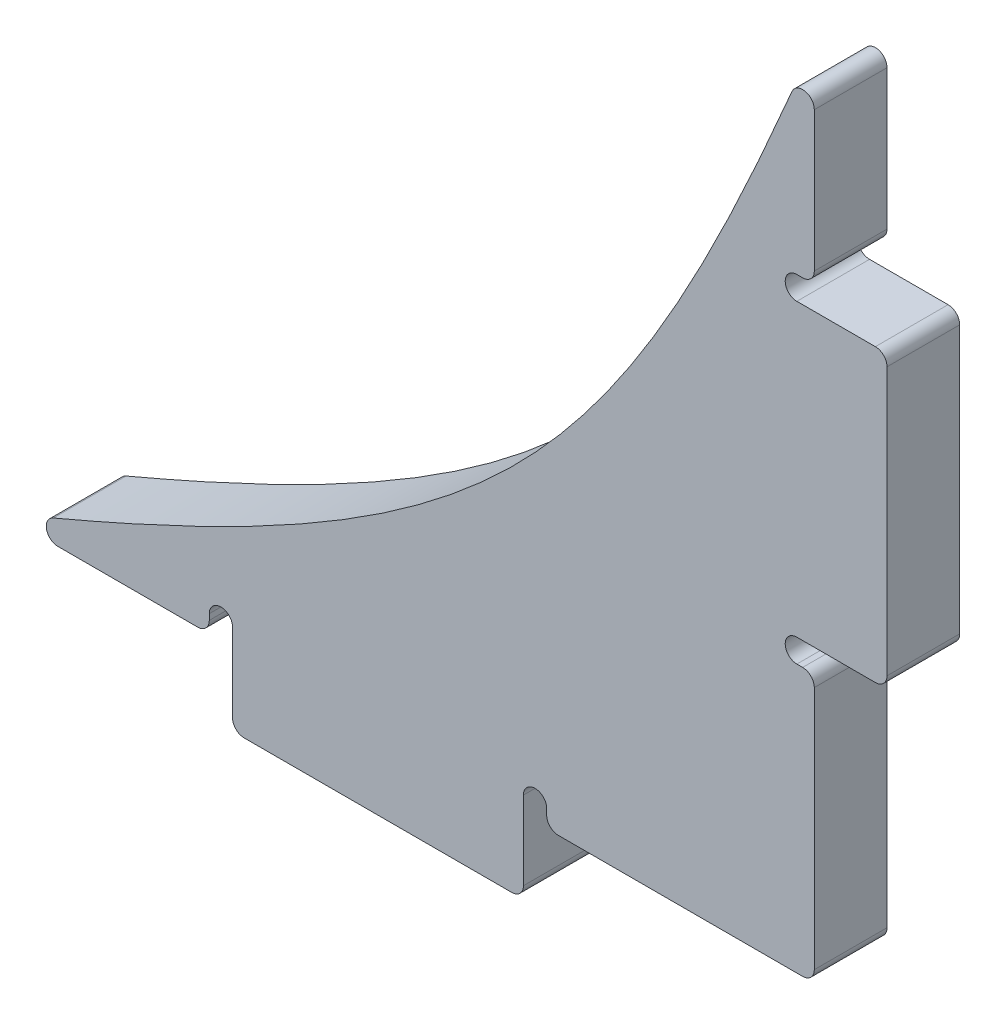
ISO-10303-21;
HEADER;
FILE_DESCRIPTION(('STEP AP214'),'2;1');
FILE_NAME('part.step','',(''),(''),'','','');
FILE_SCHEMA(('AUTOMOTIVE_DESIGN { 1 0 10303 214 1 1 1 1 }'));
ENDSEC;
DATA;
#1=APPLICATION_CONTEXT('core data for automotive mechanical design processes');
#2=APPLICATION_PROTOCOL_DEFINITION('international standard','automotive_design',2000,#1);
#3=PRODUCT_CONTEXT('',#1,'mechanical');
#4=PRODUCT('Part','Part','',(#3));
#5=PRODUCT_RELATED_PRODUCT_CATEGORY('part','',(#4));
#6=PRODUCT_DEFINITION_FORMATION('','',#4);
#7=PRODUCT_DEFINITION_CONTEXT('part definition',#1,'design');
#8=PRODUCT_DEFINITION('design','',#6,#7);
#9=PRODUCT_DEFINITION_SHAPE('','',#8);
#10=(LENGTH_UNIT() NAMED_UNIT(*) SI_UNIT(.MILLI.,.METRE.));
#11=(NAMED_UNIT(*) PLANE_ANGLE_UNIT() SI_UNIT($,.RADIAN.));
#12=(NAMED_UNIT(*) SI_UNIT($,.STERADIAN.) SOLID_ANGLE_UNIT());
#13=UNCERTAINTY_MEASURE_WITH_UNIT(LENGTH_MEASURE(1.E-05),#10,'distance_accuracy_value','');
#14=(GEOMETRIC_REPRESENTATION_CONTEXT(3) GLOBAL_UNCERTAINTY_ASSIGNED_CONTEXT((#13)) GLOBAL_UNIT_ASSIGNED_CONTEXT((#10,
#11,#12)) REPRESENTATION_CONTEXT('',''));
#15=CARTESIAN_POINT('',(0.,0.,0.));
#16=DIRECTION('',(0.,0.,1.));
#17=DIRECTION('',(1.,0.,0.));
#18=AXIS2_PLACEMENT_3D('',#15,#16,#17);
#19=CARTESIAN_POINT('',(22.86,-12.7,3.175));
#20=DIRECTION('',(-1.,0.,0.));
#21=DIRECTION('',(0.,0.,1.));
#22=AXIS2_PLACEMENT_3D('',#19,#20,#21);
#23=PLANE('',#22);
#24=DIRECTION('',(0.,1.,0.));
#25=VECTOR('',#24,1.);
#26=CARTESIAN_POINT('',(22.86,-12.7,0.));
#27=LINE('',#26,#25);
#28=CARTESIAN_POINT('',(22.86,14.224,0.));
#29=VERTEX_POINT('',#28);
#30=CARTESIAN_POINT('',(22.86,20.325877747534,0.));
#31=VERTEX_POINT('',#30);
#32=EDGE_CURVE('E343',#29,#31,#27,.T.);
#33=ORIENTED_EDGE('',*,*,#32,.T.);
#34=DIRECTION('',(0.,0.,-1.));
#35=VECTOR('',#34,1.);
#36=CARTESIAN_POINT('',(22.86,20.325877747534,3.175));
#37=LINE('',#36,#35);
#38=CARTESIAN_POINT('',(22.86,20.325877747534,3.175));
#39=VERTEX_POINT('',#38);
#40=EDGE_CURVE('E444',#31,#39,#37,.F.);
#41=ORIENTED_EDGE('',*,*,#40,.T.);
#42=DIRECTION('',(0.,1.,0.));
#43=VECTOR('',#42,1.);
#44=CARTESIAN_POINT('',(22.86,-12.7,3.175));
#45=LINE('',#44,#43);
#46=CARTESIAN_POINT('',(22.86,14.224,3.175));
#47=VERTEX_POINT('',#46);
#48=EDGE_CURVE('E348',#47,#39,#45,.T.);
#49=ORIENTED_EDGE('',*,*,#48,.F.);
#50=DIRECTION('',(0.,0.,1.));
#51=VECTOR('',#50,1.);
#52=CARTESIAN_POINT('',(22.86,14.224,3.175));
#53=LINE('',#52,#51);
#54=EDGE_CURVE('E442',#47,#29,#53,.F.);
#55=ORIENTED_EDGE('',*,*,#54,.T.);
#56=EDGE_LOOP('',(#33,#41,#49,#55));
#57=FACE_BOUND('',#56,.T.);
#58=ADVANCED_FACE('F41',(#57),#23,.F.);
#59=CARTESIAN_POINT('',(22.86,-12.192,0.));
#60=VERTEX_POINT('',#59);
#61=CARTESIAN_POINT('',(22.86,-1.52399999999999,0.));
#62=VERTEX_POINT('',#61);
#63=EDGE_CURVE('E527',#60,#62,#27,.T.);
#64=ORIENTED_EDGE('',*,*,#63,.T.);
#65=DIRECTION('',(0.,0.,1.));
#66=VECTOR('',#65,1.);
#67=CARTESIAN_POINT('',(22.86,-1.52399999999999,3.175));
#68=LINE('',#67,#66);
#69=CARTESIAN_POINT('',(22.86,-1.52399999999999,3.175));
#70=VERTEX_POINT('',#69);
#71=EDGE_CURVE('E483',#62,#70,#68,.T.);
#72=ORIENTED_EDGE('',*,*,#71,.T.);
#73=CARTESIAN_POINT('',(22.86,-12.192,3.175));
#74=VERTEX_POINT('',#73);
#75=EDGE_CURVE('E344',#74,#70,#45,.T.);
#76=ORIENTED_EDGE('',*,*,#75,.F.);
#77=DIRECTION('',(0.,0.,-1.));
#78=VECTOR('',#77,1.);
#79=CARTESIAN_POINT('',(22.86,-12.192,3.175));
#80=LINE('',#79,#78);
#81=EDGE_CURVE('E480',#74,#60,#80,.T.);
#82=ORIENTED_EDGE('',*,*,#81,.T.);
#83=EDGE_LOOP('',(#64,#72,#76,#82));
#84=FACE_BOUND('',#83,.T.);
#85=ADVANCED_FACE('F372',(#84),#23,.F.);
#86=CARTESIAN_POINT('',(22.86,-12.7,3.175));
#87=DIRECTION('',(0.,1.,0.));
#88=DIRECTION('',(-1.,0.,0.));
#89=AXIS2_PLACEMENT_3D('',#86,#87,#88);
#90=PLANE('',#89);
#91=DIRECTION('',(1.,0.,0.));
#92=VECTOR('',#91,1.);
#93=CARTESIAN_POINT('',(22.86,-12.7,0.));
#94=LINE('',#93,#92);
#95=CARTESIAN_POINT('',(-10.165877747534,-12.7,0.));
#96=VERTEX_POINT('',#95);
#97=CARTESIAN_POINT('',(-4.064,-12.7,0.));
#98=VERTEX_POINT('',#97);
#99=EDGE_CURVE('E510',#96,#98,#94,.T.);
#100=ORIENTED_EDGE('',*,*,#99,.T.);
#101=DIRECTION('',(0.,0.,1.));
#102=VECTOR('',#101,1.);
#103=CARTESIAN_POINT('',(-4.064,-12.7,3.175));
#104=LINE('',#103,#102);
#105=CARTESIAN_POINT('',(-4.064,-12.7,3.175));
#106=VERTEX_POINT('',#105);
#107=EDGE_CURVE('E49',#98,#106,#104,.T.);
#108=ORIENTED_EDGE('',*,*,#107,.T.);
#109=DIRECTION('',(1.,0.,0.));
#110=VECTOR('',#109,1.);
#111=CARTESIAN_POINT('',(22.86,-12.7,3.175));
#112=LINE('',#111,#110);
#113=CARTESIAN_POINT('',(-10.165877747534,-12.7,3.175));
#114=VERTEX_POINT('',#113);
#115=EDGE_CURVE('E355',#114,#106,#112,.T.);
#116=ORIENTED_EDGE('',*,*,#115,.F.);
#117=DIRECTION('',(0.,0.,-1.));
#118=VECTOR('',#117,1.);
#119=CARTESIAN_POINT('',(-10.165877747534,-12.7,3.175));
#120=LINE('',#119,#118);
#121=EDGE_CURVE('E505',#114,#96,#120,.T.);
#122=ORIENTED_EDGE('',*,*,#121,.T.);
#123=EDGE_LOOP('',(#100,#108,#116,#122));
#124=FACE_BOUND('',#123,.T.);
#125=ADVANCED_FACE('F368',(#124),#90,.F.);
#126=CARTESIAN_POINT('',(11.684,-12.7,0.));
#127=VERTEX_POINT('',#126);
#128=CARTESIAN_POINT('',(22.352,-12.7,0.));
#129=VERTEX_POINT('',#128);
#130=EDGE_CURVE('E535',#127,#129,#94,.T.);
#131=ORIENTED_EDGE('',*,*,#130,.T.);
#132=DIRECTION('',(0.,0.,-1.));
#133=VECTOR('',#132,1.);
#134=CARTESIAN_POINT('',(22.352,-12.7,3.175));
#135=LINE('',#134,#133);
#136=CARTESIAN_POINT('',(22.352,-12.7,3.175));
#137=VERTEX_POINT('',#136);
#138=EDGE_CURVE('E490',#129,#137,#135,.F.);
#139=ORIENTED_EDGE('',*,*,#138,.T.);
#140=CARTESIAN_POINT('',(11.684,-12.7,3.175));
#141=VERTEX_POINT('',#140);
#142=EDGE_CURVE('E354',#141,#137,#112,.T.);
#143=ORIENTED_EDGE('',*,*,#142,.F.);
#144=DIRECTION('',(0.,0.,1.));
#145=VECTOR('',#144,1.);
#146=CARTESIAN_POINT('',(11.684,-12.7,3.175));
#147=LINE('',#146,#145);
#148=EDGE_CURVE('E488',#141,#127,#147,.F.);
#149=ORIENTED_EDGE('',*,*,#148,.T.);
#150=EDGE_LOOP('',(#131,#139,#143,#149));
#151=FACE_BOUND('',#150,.T.);
#152=ADVANCED_FACE('F366',(#151),#90,.F.);
#153=CARTESIAN_POINT('',(22.86,22.86,3.175));
#154=CARTESIAN_POINT('',(14.0602561210691,1.48789755157234,3.175));
#155=CARTESIAN_POINT('',(8.67210244842766,-3.90025612106915,3.175));
#156=CARTESIAN_POINT('',(-12.7,-12.7,3.175));
#157=B_SPLINE_CURVE_WITH_KNOTS('',3,(#153,#154,#155,#156),.UNSPECIFIED.,.F.,.F.,(4,4),(0.,1.),.UNSPECIFIED.);
#158=DIRECTION('',(0.,0.,-1.));
#159=VECTOR('',#158,1.);
#160=SURFACE_OF_LINEAR_EXTRUSION('',#157,#159);
#161=CARTESIAN_POINT('',(21.8843521544961,20.5242952180239,3.175));
#162=VERTEX_POINT('',#161);
#163=CARTESIAN_POINT('',(-10.3642952180239,-11.7243521544961,3.175));
#164=VERTEX_POINT('',#163);
#165=EDGE_CURVE('E347',#162,#164,#157,.T.);
#166=ORIENTED_EDGE('',*,*,#165,.F.);
#167=DIRECTION('',(0.,0.,-1.));
#168=VECTOR('',#167,1.);
#169=CARTESIAN_POINT('',(21.8843521544961,20.5242952180239,3.175));
#170=LINE('',#169,#168);
#171=CARTESIAN_POINT('',(21.8843521544961,20.5242952180239,0.));
#172=VERTEX_POINT('',#171);
#173=EDGE_CURVE('E423',#162,#172,#170,.T.);
#174=ORIENTED_EDGE('',*,*,#173,.T.);
#175=CARTESIAN_POINT('',(22.86,22.86,0.));
#176=CARTESIAN_POINT('',(14.0602561210691,1.48789755157234,0.));
#177=CARTESIAN_POINT('',(8.67210244842766,-3.90025612106915,0.));
#178=CARTESIAN_POINT('',(-12.7,-12.7,0.));
#179=B_SPLINE_CURVE_WITH_KNOTS('',3,(#175,#176,#177,#178),.UNSPECIFIED.,.F.,.F.,(4,4),(0.,1.),.UNSPECIFIED.);
#180=CARTESIAN_POINT('',(-10.3642952180239,-11.7243521544961,0.));
#181=VERTEX_POINT('',#180);
#182=EDGE_CURVE('E533',#172,#181,#179,.T.);
#183=ORIENTED_EDGE('',*,*,#182,.T.);
#184=DIRECTION('',(0.,0.,-1.));
#185=VECTOR('',#184,1.);
#186=CARTESIAN_POINT('',(-10.3642952180239,-11.7243521544961,0.));
#187=LINE('',#186,#185);
#188=EDGE_CURVE('E513',#181,#164,#187,.F.);
#189=ORIENTED_EDGE('',*,*,#188,.T.);
#190=EDGE_LOOP('',(#166,#174,#183,#189));
#191=FACE_BOUND('',#190,.T.);
#192=ADVANCED_FACE('F361',(#191),#160,.F.);
#193=CARTESIAN_POINT('',(9.7946344635613,0.365365536438696,3.175));
#194=DIRECTION('',(0.,0.,1.));
#195=DIRECTION('',(1.,0.,0.));
#196=AXIS2_PLACEMENT_3D('',#193,#194,#195);
#197=PLANE('',#196);
#198=ORIENTED_EDGE('',*,*,#48,.T.);
#199=CARTESIAN_POINT('',(22.352,20.325877747534,3.175));
#200=DIRECTION('',(0.,0.,1.));
#201=DIRECTION('',(1.,0.,0.));
#202=AXIS2_PLACEMENT_3D('',#199,#200,#201);
#203=CIRCLE('',#202,0.508);
#204=EDGE_CURVE('E465',#39,#162,#203,.T.);
#205=ORIENTED_EDGE('',*,*,#204,.T.);
#206=ORIENTED_EDGE('',*,*,#165,.T.);
#207=CARTESIAN_POINT('',(-10.165877747534,-12.192,3.175));
#208=DIRECTION('',(0.,0.,1.));
#209=DIRECTION('',(1.,0.,0.));
#210=AXIS2_PLACEMENT_3D('',#207,#208,#209);
#211=CIRCLE('',#210,0.508);
#212=EDGE_CURVE('E446',#164,#114,#211,.T.);
#213=ORIENTED_EDGE('',*,*,#212,.T.);
#214=ORIENTED_EDGE('',*,*,#115,.T.);
#215=CARTESIAN_POINT('',(-4.064,-12.192,3.175));
#216=DIRECTION('',(0.,0.,1.));
#217=DIRECTION('',(1.,0.,0.));
#218=AXIS2_PLACEMENT_3D('',#215,#216,#217);
#219=CIRCLE('',#218,0.508);
#220=CARTESIAN_POINT('',(-3.556,-12.192,3.175));
#221=VERTEX_POINT('',#220);
#222=EDGE_CURVE('E56',#106,#221,#219,.T.);
#223=ORIENTED_EDGE('',*,*,#222,.T.);
#224=DIRECTION('',(0.,-1.,0.));
#225=VECTOR('',#224,1.);
#226=CARTESIAN_POINT('',(-3.556,-11.938,3.175));
#227=LINE('',#226,#225);
#228=CARTESIAN_POINT('',(-3.556,-11.938,3.175));
#229=VERTEX_POINT('',#228);
#230=EDGE_CURVE('E255',#229,#221,#227,.T.);
#231=ORIENTED_EDGE('',*,*,#230,.F.);
#232=CARTESIAN_POINT('',(-3.048,-11.938,3.175));
#233=DIRECTION('',(0.,0.,1.));
#234=DIRECTION('',(1.,0.,0.));
#235=AXIS2_PLACEMENT_3D('',#232,#233,#234);
#236=CIRCLE('',#235,0.507999999999999);
#237=CARTESIAN_POINT('',(-2.54,-11.938,3.175));
#238=VERTEX_POINT('',#237);
#239=EDGE_CURVE('E254',#238,#229,#236,.T.);
#240=ORIENTED_EDGE('',*,*,#239,.F.);
#241=DIRECTION('',(0.,1.,0.));
#242=VECTOR('',#241,1.);
#243=CARTESIAN_POINT('',(-2.54,-15.875,3.175));
#244=LINE('',#243,#242);
#245=CARTESIAN_POINT('',(-2.54,-15.367,3.175));
#246=VERTEX_POINT('',#245);
#247=EDGE_CURVE('E336',#246,#238,#244,.T.);
#248=ORIENTED_EDGE('',*,*,#247,.F.);
#249=CARTESIAN_POINT('',(-2.032,-15.367,3.175));
#250=DIRECTION('',(0.,0.,1.));
#251=DIRECTION('',(1.,0.,0.));
#252=AXIS2_PLACEMENT_3D('',#249,#250,#251);
#253=CIRCLE('',#252,0.508);
#254=CARTESIAN_POINT('',(-2.032,-15.875,3.175));
#255=VERTEX_POINT('',#254);
#256=EDGE_CURVE('E449',#246,#255,#253,.T.);
#257=ORIENTED_EDGE('',*,*,#256,.T.);
#258=DIRECTION('',(-1.,0.,0.));
#259=VECTOR('',#258,1.);
#260=CARTESIAN_POINT('',(-2.54,-15.875,3.175));
#261=LINE('',#260,#259);
#262=CARTESIAN_POINT('',(9.652,-15.875,3.175));
#263=VERTEX_POINT('',#262);
#264=EDGE_CURVE('E333',#263,#255,#261,.T.);
#265=ORIENTED_EDGE('',*,*,#264,.F.);
#266=CARTESIAN_POINT('',(9.652,-15.367,3.175));
#267=DIRECTION('',(0.,0.,1.));
#268=DIRECTION('',(1.,0.,0.));
#269=AXIS2_PLACEMENT_3D('',#266,#267,#268);
#270=CIRCLE('',#269,0.508);
#271=CARTESIAN_POINT('',(10.16,-15.367,3.175));
#272=VERTEX_POINT('',#271);
#273=EDGE_CURVE('E451',#263,#272,#270,.T.);
#274=ORIENTED_EDGE('',*,*,#273,.T.);
#275=DIRECTION('',(0.,1.,0.));
#276=VECTOR('',#275,1.);
#277=CARTESIAN_POINT('',(10.16,-15.875,3.175));
#278=LINE('',#277,#276);
#279=CARTESIAN_POINT('',(10.16,-11.938,3.175));
#280=VERTEX_POINT('',#279);
#281=EDGE_CURVE('E338',#272,#280,#278,.T.);
#282=ORIENTED_EDGE('',*,*,#281,.T.);
#283=CARTESIAN_POINT('',(10.668,-11.938,3.175));
#284=DIRECTION('',(0.,0.,1.));
#285=DIRECTION('',(1.,0.,0.));
#286=AXIS2_PLACEMENT_3D('',#283,#284,#285);
#287=CIRCLE('',#286,0.508000000000001);
#288=CARTESIAN_POINT('',(11.176,-11.938,3.175));
#289=VERTEX_POINT('',#288);
#290=EDGE_CURVE('E278',#289,#280,#287,.T.);
#291=ORIENTED_EDGE('',*,*,#290,.F.);
#292=DIRECTION('',(0.,1.,0.));
#293=VECTOR('',#292,1.);
#294=CARTESIAN_POINT('',(11.176,-12.7,3.175));
#295=LINE('',#294,#293);
#296=CARTESIAN_POINT('',(11.176,-12.192,3.175));
#297=VERTEX_POINT('',#296);
#298=EDGE_CURVE('E281',#297,#289,#295,.T.);
#299=ORIENTED_EDGE('',*,*,#298,.F.);
#300=CARTESIAN_POINT('',(11.684,-12.192,3.175));
#301=DIRECTION('',(0.,0.,1.));
#302=DIRECTION('',(1.,0.,0.));
#303=AXIS2_PLACEMENT_3D('',#300,#301,#302);
#304=CIRCLE('',#303,0.508);
#305=EDGE_CURVE('E453',#297,#141,#304,.T.);
#306=ORIENTED_EDGE('',*,*,#305,.T.);
#307=ORIENTED_EDGE('',*,*,#142,.T.);
#308=CARTESIAN_POINT('',(22.352,-12.192,3.175));
#309=DIRECTION('',(0.,0.,1.));
#310=DIRECTION('',(1.,0.,0.));
#311=AXIS2_PLACEMENT_3D('',#308,#309,#310);
#312=CIRCLE('',#311,0.508);
#313=EDGE_CURVE('E455',#137,#74,#312,.T.);
#314=ORIENTED_EDGE('',*,*,#313,.T.);
#315=ORIENTED_EDGE('',*,*,#75,.T.);
#316=CARTESIAN_POINT('',(22.352,-1.52399999999999,3.175));
#317=DIRECTION('',(0.,0.,1.));
#318=DIRECTION('',(1.,0.,0.));
#319=AXIS2_PLACEMENT_3D('',#316,#317,#318);
#320=CIRCLE('',#319,0.508);
#321=CARTESIAN_POINT('',(22.352,-1.01599999999999,3.175));
#322=VERTEX_POINT('',#321);
#323=EDGE_CURVE('E457',#70,#322,#320,.T.);
#324=ORIENTED_EDGE('',*,*,#323,.T.);
#325=DIRECTION('',(1.,0.,0.));
#326=VECTOR('',#325,1.);
#327=CARTESIAN_POINT('',(22.098,-1.01599999999999,3.175));
#328=LINE('',#327,#326);
#329=CARTESIAN_POINT('',(22.098,-1.01599999999999,3.175));
#330=VERTEX_POINT('',#329);
#331=EDGE_CURVE('E292',#330,#322,#328,.T.);
#332=ORIENTED_EDGE('',*,*,#331,.F.);
#333=CARTESIAN_POINT('',(22.098,-0.507999999999995,3.175));
#334=DIRECTION('',(0.,0.,1.));
#335=DIRECTION('',(1.,0.,0.));
#336=AXIS2_PLACEMENT_3D('',#333,#334,#335);
#337=CIRCLE('',#336,0.507999999999997);
#338=CARTESIAN_POINT('',(22.098,0.,3.175));
#339=VERTEX_POINT('',#338);
#340=EDGE_CURVE('E288',#339,#330,#337,.T.);
#341=ORIENTED_EDGE('',*,*,#340,.F.);
#342=DIRECTION('',(-1.,0.,0.));
#343=VECTOR('',#342,1.);
#344=CARTESIAN_POINT('',(26.035,0.,3.175));
#345=LINE('',#344,#343);
#346=CARTESIAN_POINT('',(25.527,0.,3.175));
#347=VERTEX_POINT('',#346);
#348=EDGE_CURVE('E328',#347,#339,#345,.T.);
#349=ORIENTED_EDGE('',*,*,#348,.F.);
#350=CARTESIAN_POINT('',(25.527,0.508000000000005,3.175));
#351=DIRECTION('',(0.,0.,1.));
#352=DIRECTION('',(1.,0.,0.));
#353=AXIS2_PLACEMENT_3D('',#350,#351,#352);
#354=CIRCLE('',#353,0.508);
#355=CARTESIAN_POINT('',(26.035,0.508000000000005,3.175));
#356=VERTEX_POINT('',#355);
#357=EDGE_CURVE('E459',#347,#356,#354,.T.);
#358=ORIENTED_EDGE('',*,*,#357,.T.);
#359=DIRECTION('',(0.,-1.,0.));
#360=VECTOR('',#359,1.);
#361=CARTESIAN_POINT('',(26.035,0.,3.175));
#362=LINE('',#361,#360);
#363=CARTESIAN_POINT('',(26.035,12.192,3.175));
#364=VERTEX_POINT('',#363);
#365=EDGE_CURVE('E245',#364,#356,#362,.T.);
#366=ORIENTED_EDGE('',*,*,#365,.F.);
#367=CARTESIAN_POINT('',(25.527,12.192,3.175));
#368=DIRECTION('',(0.,0.,1.));
#369=DIRECTION('',(1.,0.,0.));
#370=AXIS2_PLACEMENT_3D('',#367,#368,#369);
#371=CIRCLE('',#370,0.508);
#372=CARTESIAN_POINT('',(25.527,12.7,3.175));
#373=VERTEX_POINT('',#372);
#374=EDGE_CURVE('E461',#364,#373,#371,.T.);
#375=ORIENTED_EDGE('',*,*,#374,.T.);
#376=DIRECTION('',(-1.,0.,0.));
#377=VECTOR('',#376,1.);
#378=CARTESIAN_POINT('',(26.035,12.7,3.175));
#379=LINE('',#378,#377);
#380=CARTESIAN_POINT('',(22.098,12.7,3.175));
#381=VERTEX_POINT('',#380);
#382=EDGE_CURVE('E322',#373,#381,#379,.T.);
#383=ORIENTED_EDGE('',*,*,#382,.T.);
#384=CARTESIAN_POINT('',(22.098,13.208,3.175));
#385=DIRECTION('',(0.,0.,1.));
#386=DIRECTION('',(1.,0.,0.));
#387=AXIS2_PLACEMENT_3D('',#384,#385,#386);
#388=CIRCLE('',#387,0.508000000000002);
#389=CARTESIAN_POINT('',(22.098,13.716,3.175));
#390=VERTEX_POINT('',#389);
#391=EDGE_CURVE('E307',#390,#381,#388,.T.);
#392=ORIENTED_EDGE('',*,*,#391,.F.);
#393=DIRECTION('',(-1.,0.,0.));
#394=VECTOR('',#393,1.);
#395=CARTESIAN_POINT('',(22.86,13.716,3.175));
#396=LINE('',#395,#394);
#397=CARTESIAN_POINT('',(22.352,13.716,3.175));
#398=VERTEX_POINT('',#397);
#399=EDGE_CURVE('E310',#398,#390,#396,.T.);
#400=ORIENTED_EDGE('',*,*,#399,.F.);
#401=CARTESIAN_POINT('',(22.352,14.224,3.175));
#402=DIRECTION('',(0.,0.,1.));
#403=DIRECTION('',(1.,0.,0.));
#404=AXIS2_PLACEMENT_3D('',#401,#402,#403);
#405=CIRCLE('',#404,0.508);
#406=EDGE_CURVE('E463',#398,#47,#405,.T.);
#407=ORIENTED_EDGE('',*,*,#406,.T.);
#408=EDGE_LOOP('',(#198,#205,#206,#213,#214,#223,#231,#240,#248,#257,#265,#274,#282,#291,#299,
#306,#307,#314,#315,#324,#332,#341,#349,#358,#366,#375,#383,#392,#400,#407));
#409=FACE_BOUND('',#408,.T.);
#410=ADVANCED_FACE('F365',(#409),#197,.T.);
#411=CARTESIAN_POINT('',(9.7946344635613,0.365365536438696,0.));
#412=DIRECTION('',(0.,0.,1.));
#413=DIRECTION('',(1.,0.,0.));
#414=AXIS2_PLACEMENT_3D('',#411,#412,#413);
#415=PLANE('',#414);
#416=ORIENTED_EDGE('',*,*,#182,.F.);
#417=CARTESIAN_POINT('',(22.352,20.325877747534,0.));
#418=DIRECTION('',(0.,0.,1.));
#419=DIRECTION('',(1.,0.,0.));
#420=AXIS2_PLACEMENT_3D('',#417,#418,#419);
#421=CIRCLE('',#420,0.508);
#422=EDGE_CURVE('E440',#172,#31,#421,.F.);
#423=ORIENTED_EDGE('',*,*,#422,.T.);
#424=ORIENTED_EDGE('',*,*,#32,.F.);
#425=CARTESIAN_POINT('',(22.352,14.224,0.));
#426=DIRECTION('',(0.,0.,1.));
#427=DIRECTION('',(1.,0.,0.));
#428=AXIS2_PLACEMENT_3D('',#425,#426,#427);
#429=CIRCLE('',#428,0.508);
#430=CARTESIAN_POINT('',(22.352,13.716,0.));
#431=VERTEX_POINT('',#430);
#432=EDGE_CURVE('E438',#29,#431,#429,.F.);
#433=ORIENTED_EDGE('',*,*,#432,.T.);
#434=DIRECTION('',(1.,0.,0.));
#435=VECTOR('',#434,1.);
#436=CARTESIAN_POINT('',(22.86,13.716,0.));
#437=LINE('',#436,#435);
#438=CARTESIAN_POINT('',(22.098,13.716,0.));
#439=VERTEX_POINT('',#438);
#440=EDGE_CURVE('E304',#439,#431,#437,.T.);
#441=ORIENTED_EDGE('',*,*,#440,.F.);
#442=CARTESIAN_POINT('',(22.098,13.208,0.));
#443=DIRECTION('',(0.,0.,1.));
#444=DIRECTION('',(1.,0.,0.));
#445=AXIS2_PLACEMENT_3D('',#442,#443,#444);
#446=CIRCLE('',#445,0.508000000000002);
#447=CARTESIAN_POINT('',(22.098,12.7,0.));
#448=VERTEX_POINT('',#447);
#449=EDGE_CURVE('E301',#448,#439,#446,.F.);
#450=ORIENTED_EDGE('',*,*,#449,.F.);
#451=DIRECTION('',(-1.,0.,0.));
#452=VECTOR('',#451,1.);
#453=CARTESIAN_POINT('',(26.035,12.7,0.));
#454=LINE('',#453,#452);
#455=CARTESIAN_POINT('',(25.527,12.7,0.));
#456=VERTEX_POINT('',#455);
#457=EDGE_CURVE('E324',#456,#448,#454,.T.);
#458=ORIENTED_EDGE('',*,*,#457,.F.);
#459=CARTESIAN_POINT('',(25.527,12.192,0.));
#460=DIRECTION('',(0.,0.,1.));
#461=DIRECTION('',(1.,0.,0.));
#462=AXIS2_PLACEMENT_3D('',#459,#460,#461);
#463=CIRCLE('',#462,0.508);
#464=CARTESIAN_POINT('',(26.035,12.192,0.));
#465=VERTEX_POINT('',#464);
#466=EDGE_CURVE('E436',#456,#465,#463,.F.);
#467=ORIENTED_EDGE('',*,*,#466,.T.);
#468=DIRECTION('',(0.,1.,0.));
#469=VECTOR('',#468,1.);
#470=CARTESIAN_POINT('',(26.035,0.,0.));
#471=LINE('',#470,#469);
#472=CARTESIAN_POINT('',(26.035,0.508000000000005,0.));
#473=VERTEX_POINT('',#472);
#474=EDGE_CURVE('E319',#473,#465,#471,.T.);
#475=ORIENTED_EDGE('',*,*,#474,.F.);
#476=CARTESIAN_POINT('',(25.527,0.508000000000005,0.));
#477=DIRECTION('',(0.,0.,1.));
#478=DIRECTION('',(1.,0.,0.));
#479=AXIS2_PLACEMENT_3D('',#476,#477,#478);
#480=CIRCLE('',#479,0.508);
#481=CARTESIAN_POINT('',(25.527,0.,0.));
#482=VERTEX_POINT('',#481);
#483=EDGE_CURVE('E434',#473,#482,#480,.F.);
#484=ORIENTED_EDGE('',*,*,#483,.T.);
#485=DIRECTION('',(-1.,0.,0.));
#486=VECTOR('',#485,1.);
#487=CARTESIAN_POINT('',(26.035,0.,0.));
#488=LINE('',#487,#486);
#489=CARTESIAN_POINT('',(22.098,0.,0.));
#490=VERTEX_POINT('',#489);
#491=EDGE_CURVE('E326',#482,#490,#488,.T.);
#492=ORIENTED_EDGE('',*,*,#491,.T.);
#493=CARTESIAN_POINT('',(22.098,-0.507999999999995,0.));
#494=DIRECTION('',(0.,0.,1.));
#495=DIRECTION('',(1.,0.,0.));
#496=AXIS2_PLACEMENT_3D('',#493,#494,#495);
#497=CIRCLE('',#496,0.507999999999997);
#498=CARTESIAN_POINT('',(22.098,-1.01599999999999,0.));
#499=VERTEX_POINT('',#498);
#500=EDGE_CURVE('E285',#499,#490,#497,.F.);
#501=ORIENTED_EDGE('',*,*,#500,.F.);
#502=DIRECTION('',(-1.,0.,0.));
#503=VECTOR('',#502,1.);
#504=CARTESIAN_POINT('',(22.098,-1.01599999999999,0.));
#505=LINE('',#504,#503);
#506=CARTESIAN_POINT('',(22.352,-1.01599999999999,0.));
#507=VERTEX_POINT('',#506);
#508=EDGE_CURVE('E275',#507,#499,#505,.T.);
#509=ORIENTED_EDGE('',*,*,#508,.F.);
#510=CARTESIAN_POINT('',(22.352,-1.52399999999999,0.));
#511=DIRECTION('',(0.,0.,1.));
#512=DIRECTION('',(1.,0.,0.));
#513=AXIS2_PLACEMENT_3D('',#510,#511,#512);
#514=CIRCLE('',#513,0.508);
#515=EDGE_CURVE('E432',#507,#62,#514,.F.);
#516=ORIENTED_EDGE('',*,*,#515,.T.);
#517=ORIENTED_EDGE('',*,*,#63,.F.);
#518=CARTESIAN_POINT('',(22.352,-12.192,0.));
#519=DIRECTION('',(0.,0.,1.));
#520=DIRECTION('',(1.,0.,0.));
#521=AXIS2_PLACEMENT_3D('',#518,#519,#520);
#522=CIRCLE('',#521,0.508);
#523=EDGE_CURVE('E430',#60,#129,#522,.F.);
#524=ORIENTED_EDGE('',*,*,#523,.T.);
#525=ORIENTED_EDGE('',*,*,#130,.F.);
#526=CARTESIAN_POINT('',(11.684,-12.192,0.));
#527=DIRECTION('',(0.,0.,1.));
#528=DIRECTION('',(1.,0.,0.));
#529=AXIS2_PLACEMENT_3D('',#526,#527,#528);
#530=CIRCLE('',#529,0.508);
#531=CARTESIAN_POINT('',(11.176,-12.192,0.));
#532=VERTEX_POINT('',#531);
#533=EDGE_CURVE('E428',#127,#532,#530,.F.);
#534=ORIENTED_EDGE('',*,*,#533,.T.);
#535=DIRECTION('',(0.,-1.,0.));
#536=VECTOR('',#535,1.);
#537=CARTESIAN_POINT('',(11.176,-12.7,0.));
#538=LINE('',#537,#536);
#539=CARTESIAN_POINT('',(11.176,-11.938,0.));
#540=VERTEX_POINT('',#539);
#541=EDGE_CURVE('E274',#540,#532,#538,.T.);
#542=ORIENTED_EDGE('',*,*,#541,.F.);
#543=CARTESIAN_POINT('',(10.668,-11.938,0.));
#544=DIRECTION('',(0.,0.,1.));
#545=DIRECTION('',(1.,0.,0.));
#546=AXIS2_PLACEMENT_3D('',#543,#544,#545);
#547=CIRCLE('',#546,0.508000000000001);
#548=CARTESIAN_POINT('',(10.16,-11.938,0.));
#549=VERTEX_POINT('',#548);
#550=EDGE_CURVE('E271',#549,#540,#547,.F.);
#551=ORIENTED_EDGE('',*,*,#550,.F.);
#552=DIRECTION('',(0.,1.,0.));
#553=VECTOR('',#552,1.);
#554=CARTESIAN_POINT('',(10.16,-15.875,0.));
#555=LINE('',#554,#553);
#556=CARTESIAN_POINT('',(10.16,-15.367,0.));
#557=VERTEX_POINT('',#556);
#558=EDGE_CURVE('E340',#557,#549,#555,.T.);
#559=ORIENTED_EDGE('',*,*,#558,.F.);
#560=CARTESIAN_POINT('',(9.652,-15.367,0.));
#561=DIRECTION('',(0.,0.,1.));
#562=DIRECTION('',(1.,0.,0.));
#563=AXIS2_PLACEMENT_3D('',#560,#561,#562);
#564=CIRCLE('',#563,0.508);
#565=CARTESIAN_POINT('',(9.652,-15.875,0.));
#566=VERTEX_POINT('',#565);
#567=EDGE_CURVE('E421',#557,#566,#564,.F.);
#568=ORIENTED_EDGE('',*,*,#567,.T.);
#569=DIRECTION('',(1.,0.,0.));
#570=VECTOR('',#569,1.);
#571=CARTESIAN_POINT('',(-2.54,-15.875,0.));
#572=LINE('',#571,#570);
#573=CARTESIAN_POINT('',(-2.032,-15.875,0.));
#574=VERTEX_POINT('',#573);
#575=EDGE_CURVE('E330',#574,#566,#572,.T.);
#576=ORIENTED_EDGE('',*,*,#575,.F.);
#577=CARTESIAN_POINT('',(-2.032,-15.367,0.));
#578=DIRECTION('',(0.,0.,1.));
#579=DIRECTION('',(1.,0.,0.));
#580=AXIS2_PLACEMENT_3D('',#577,#578,#579);
#581=CIRCLE('',#580,0.508);
#582=CARTESIAN_POINT('',(-2.54,-15.367,0.));
#583=VERTEX_POINT('',#582);
#584=EDGE_CURVE('E418',#574,#583,#581,.F.);
#585=ORIENTED_EDGE('',*,*,#584,.T.);
#586=DIRECTION('',(0.,1.,0.));
#587=VECTOR('',#586,1.);
#588=CARTESIAN_POINT('',(-2.54,-15.875,0.));
#589=LINE('',#588,#587);
#590=CARTESIAN_POINT('',(-2.54,-11.938,0.));
#591=VERTEX_POINT('',#590);
#592=EDGE_CURVE('E260',#583,#591,#589,.T.);
#593=ORIENTED_EDGE('',*,*,#592,.T.);
#594=CARTESIAN_POINT('',(-3.048,-11.938,0.));
#595=DIRECTION('',(0.,0.,1.));
#596=DIRECTION('',(1.,0.,0.));
#597=AXIS2_PLACEMENT_3D('',#594,#595,#596);
#598=CIRCLE('',#597,0.507999999999999);
#599=CARTESIAN_POINT('',(-3.556,-11.938,0.));
#600=VERTEX_POINT('',#599);
#601=EDGE_CURVE('E252',#600,#591,#598,.F.);
#602=ORIENTED_EDGE('',*,*,#601,.F.);
#603=DIRECTION('',(0.,1.,0.));
#604=VECTOR('',#603,1.);
#605=CARTESIAN_POINT('',(-3.556,-11.938,0.));
#606=LINE('',#605,#604);
#607=CARTESIAN_POINT('',(-3.556,-12.192,0.));
#608=VERTEX_POINT('',#607);
#609=EDGE_CURVE('E237',#608,#600,#606,.T.);
#610=ORIENTED_EDGE('',*,*,#609,.F.);
#611=CARTESIAN_POINT('',(-4.064,-12.192,0.));
#612=DIRECTION('',(0.,0.,1.));
#613=DIRECTION('',(1.,0.,0.));
#614=AXIS2_PLACEMENT_3D('',#611,#612,#613);
#615=CIRCLE('',#614,0.508);
#616=EDGE_CURVE('E415',#608,#98,#615,.F.);
#617=ORIENTED_EDGE('',*,*,#616,.T.);
#618=ORIENTED_EDGE('',*,*,#99,.F.);
#619=CARTESIAN_POINT('',(-10.165877747534,-12.192,0.));
#620=DIRECTION('',(0.,0.,1.));
#621=DIRECTION('',(1.,0.,0.));
#622=AXIS2_PLACEMENT_3D('',#619,#620,#621);
#623=CIRCLE('',#622,0.508);
#624=EDGE_CURVE('E419',#96,#181,#623,.F.);
#625=ORIENTED_EDGE('',*,*,#624,.T.);
#626=EDGE_LOOP('',(#416,#423,#424,#433,#441,#450,#458,#467,#475,#484,#492,#501,#509,#516,#517,
#524,#525,#534,#542,#551,#559,#568,#576,#585,#593,#602,#610,#617,#618,#625));
#627=FACE_BOUND('',#626,.T.);
#628=ADVANCED_FACE('F258',(#627),#415,.F.);
#629=CARTESIAN_POINT('',(-2.54,-15.875,3.175));
#630=DIRECTION('',(1.,0.,0.));
#631=DIRECTION('',(0.,1.,0.));
#632=AXIS2_PLACEMENT_3D('',#629,#630,#631);
#633=PLANE('',#632);
#634=ORIENTED_EDGE('',*,*,#592,.F.);
#635=DIRECTION('',(0.,0.,-1.));
#636=VECTOR('',#635,1.);
#637=CARTESIAN_POINT('',(-2.54,-15.367,3.175));
#638=LINE('',#637,#636);
#639=EDGE_CURVE('E503',#583,#246,#638,.F.);
#640=ORIENTED_EDGE('',*,*,#639,.T.);
#641=ORIENTED_EDGE('',*,*,#247,.T.);
#642=DIRECTION('',(0.,0.,1.));
#643=VECTOR('',#642,1.);
#644=CARTESIAN_POINT('',(-2.54,-11.938,-0.00100000000000013));
#645=LINE('',#644,#643);
#646=EDGE_CURVE('E246',#591,#238,#645,.T.);
#647=ORIENTED_EDGE('',*,*,#646,.F.);
#648=EDGE_LOOP('',(#634,#640,#641,#647));
#649=FACE_BOUND('',#648,.T.);
#650=ADVANCED_FACE('F622',(#649),#633,.F.);
#651=CARTESIAN_POINT('',(10.16,-15.875,3.175));
#652=DIRECTION('',(-1.,0.,0.));
#653=DIRECTION('',(0.,-1.,0.));
#654=AXIS2_PLACEMENT_3D('',#651,#652,#653);
#655=PLANE('',#654);
#656=ORIENTED_EDGE('',*,*,#281,.F.);
#657=DIRECTION('',(0.,0.,1.));
#658=VECTOR('',#657,1.);
#659=CARTESIAN_POINT('',(10.16,-15.367,0.));
#660=LINE('',#659,#658);
#661=EDGE_CURVE('E501',#272,#557,#660,.F.);
#662=ORIENTED_EDGE('',*,*,#661,.T.);
#663=ORIENTED_EDGE('',*,*,#558,.T.);
#664=DIRECTION('',(0.,0.,1.));
#665=VECTOR('',#664,1.);
#666=CARTESIAN_POINT('',(10.16,-11.938,-0.00100000000000013));
#667=LINE('',#666,#665);
#668=EDGE_CURVE('E266',#549,#280,#667,.T.);
#669=ORIENTED_EDGE('',*,*,#668,.T.);
#670=EDGE_LOOP('',(#656,#662,#663,#669));
#671=FACE_BOUND('',#670,.T.);
#672=ADVANCED_FACE('F618',(#671),#655,.F.);
#673=CARTESIAN_POINT('',(0.,-15.875,0.));
#674=DIRECTION('',(0.,-1.,0.));
#675=DIRECTION('',(0.,0.,-1.));
#676=AXIS2_PLACEMENT_3D('',#673,#674,#675);
#677=PLANE('',#676);
#678=ORIENTED_EDGE('',*,*,#575,.T.);
#679=DIRECTION('',(0.,0.,1.));
#680=VECTOR('',#679,1.);
#681=CARTESIAN_POINT('',(9.652,-15.875,3.175));
#682=LINE('',#681,#680);
#683=EDGE_CURVE('E498',#566,#263,#682,.T.);
#684=ORIENTED_EDGE('',*,*,#683,.T.);
#685=ORIENTED_EDGE('',*,*,#264,.T.);
#686=DIRECTION('',(0.,0.,-1.));
#687=VECTOR('',#686,1.);
#688=CARTESIAN_POINT('',(-2.032,-15.875,0.));
#689=LINE('',#688,#687);
#690=EDGE_CURVE('E495',#255,#574,#689,.T.);
#691=ORIENTED_EDGE('',*,*,#690,.T.);
#692=EDGE_LOOP('',(#678,#684,#685,#691));
#693=FACE_BOUND('',#692,.T.);
#694=ADVANCED_FACE('F615',(#693),#677,.T.);
#695=CARTESIAN_POINT('',(26.035,0.,3.175));
#696=DIRECTION('',(0.,1.,0.));
#697=DIRECTION('',(0.,0.,1.));
#698=AXIS2_PLACEMENT_3D('',#695,#696,#697);
#699=PLANE('',#698);
#700=ORIENTED_EDGE('',*,*,#491,.F.);
#701=DIRECTION('',(0.,0.,-1.));
#702=VECTOR('',#701,1.);
#703=CARTESIAN_POINT('',(25.527,0.,3.175));
#704=LINE('',#703,#702);
#705=EDGE_CURVE('E478',#482,#347,#704,.F.);
#706=ORIENTED_EDGE('',*,*,#705,.T.);
#707=ORIENTED_EDGE('',*,*,#348,.T.);
#708=DIRECTION('',(0.,0.,1.));
#709=VECTOR('',#708,1.);
#710=CARTESIAN_POINT('',(22.098,0.,-0.00100000000000013));
#711=LINE('',#710,#709);
#712=EDGE_CURVE('E296',#490,#339,#711,.T.);
#713=ORIENTED_EDGE('',*,*,#712,.F.);
#714=EDGE_LOOP('',(#700,#706,#707,#713));
#715=FACE_BOUND('',#714,.T.);
#716=ADVANCED_FACE('F583',(#715),#699,.F.);
#717=CARTESIAN_POINT('',(26.035,12.7,3.175));
#718=DIRECTION('',(0.,-1.,0.));
#719=DIRECTION('',(0.,0.,-1.));
#720=AXIS2_PLACEMENT_3D('',#717,#718,#719);
#721=PLANE('',#720);
#722=ORIENTED_EDGE('',*,*,#382,.F.);
#723=DIRECTION('',(0.,0.,1.));
#724=VECTOR('',#723,1.);
#725=CARTESIAN_POINT('',(25.527,12.7,3.175));
#726=LINE('',#725,#724);
#727=EDGE_CURVE('E476',#373,#456,#726,.F.);
#728=ORIENTED_EDGE('',*,*,#727,.T.);
#729=ORIENTED_EDGE('',*,*,#457,.T.);
#730=DIRECTION('',(0.,0.,1.));
#731=VECTOR('',#730,1.);
#732=CARTESIAN_POINT('',(22.098,12.7,-0.00100000000000013));
#733=LINE('',#732,#731);
#734=EDGE_CURVE('E312',#448,#381,#733,.T.);
#735=ORIENTED_EDGE('',*,*,#734,.T.);
#736=EDGE_LOOP('',(#722,#728,#729,#735));
#737=FACE_BOUND('',#736,.T.);
#738=ADVANCED_FACE('F610',(#737),#721,.F.);
#739=CARTESIAN_POINT('',(26.035,0.,0.));
#740=DIRECTION('',(-1.,0.,0.));
#741=DIRECTION('',(0.,0.,1.));
#742=AXIS2_PLACEMENT_3D('',#739,#740,#741);
#743=PLANE('',#742);
#744=ORIENTED_EDGE('',*,*,#474,.T.);
#745=DIRECTION('',(0.,0.,1.));
#746=VECTOR('',#745,1.);
#747=CARTESIAN_POINT('',(26.035,12.192,0.));
#748=LINE('',#747,#746);
#749=EDGE_CURVE('E473',#465,#364,#748,.T.);
#750=ORIENTED_EDGE('',*,*,#749,.T.);
#751=ORIENTED_EDGE('',*,*,#365,.T.);
#752=DIRECTION('',(0.,0.,-1.));
#753=VECTOR('',#752,1.);
#754=CARTESIAN_POINT('',(26.035,0.508000000000005,0.));
#755=LINE('',#754,#753);
#756=EDGE_CURVE('E470',#356,#473,#755,.T.);
#757=ORIENTED_EDGE('',*,*,#756,.T.);
#758=EDGE_LOOP('',(#744,#750,#751,#757));
#759=FACE_BOUND('',#758,.T.);
#760=ADVANCED_FACE('F573',(#759),#743,.F.);
#761=CARTESIAN_POINT('',(22.098,13.208,-0.00100000000000013));
#762=DIRECTION('',(0.,0.,1.));
#763=DIRECTION('',(1.,0.,0.));
#764=AXIS2_PLACEMENT_3D('',#761,#762,#763);
#765=CYLINDRICAL_SURFACE('',#764,0.508000000000002);
#766=ORIENTED_EDGE('',*,*,#449,.T.);
#767=DIRECTION('',(0.,0.,1.));
#768=VECTOR('',#767,1.);
#769=CARTESIAN_POINT('',(22.098,13.716,-0.00100000000000013));
#770=LINE('',#769,#768);
#771=EDGE_CURVE('E289',#439,#390,#770,.T.);
#772=ORIENTED_EDGE('',*,*,#771,.T.);
#773=ORIENTED_EDGE('',*,*,#391,.T.);
#774=ORIENTED_EDGE('',*,*,#734,.F.);
#775=EDGE_LOOP('',(#766,#772,#773,#774));
#776=FACE_BOUND('',#775,.T.);
#777=ADVANCED_FACE('F563',(#776),#765,.F.);
#778=CARTESIAN_POINT('',(22.86,13.716,-0.00100000000000013));
#779=DIRECTION('',(0.,1.,0.));
#780=DIRECTION('',(-1.,0.,0.));
#781=AXIS2_PLACEMENT_3D('',#778,#779,#780);
#782=PLANE('',#781);
#783=ORIENTED_EDGE('',*,*,#440,.T.);
#784=DIRECTION('',(0.,0.,1.));
#785=VECTOR('',#784,1.);
#786=CARTESIAN_POINT('',(22.352,13.716,-0.00100000000000013));
#787=LINE('',#786,#785);
#788=EDGE_CURVE('E467',#431,#398,#787,.T.);
#789=ORIENTED_EDGE('',*,*,#788,.T.);
#790=ORIENTED_EDGE('',*,*,#399,.T.);
#791=ORIENTED_EDGE('',*,*,#771,.F.);
#792=EDGE_LOOP('',(#783,#789,#790,#791));
#793=FACE_BOUND('',#792,.T.);
#794=ADVANCED_FACE('F558',(#793),#782,.F.);
#795=CARTESIAN_POINT('',(22.098,-0.507999999999995,-0.00100000000000013));
#796=DIRECTION('',(0.,0.,1.));
#797=DIRECTION('',(1.,0.,0.));
#798=AXIS2_PLACEMENT_3D('',#795,#796,#797);
#799=CYLINDRICAL_SURFACE('',#798,0.507999999999997);
#800=ORIENTED_EDGE('',*,*,#500,.T.);
#801=ORIENTED_EDGE('',*,*,#712,.T.);
#802=ORIENTED_EDGE('',*,*,#340,.T.);
#803=DIRECTION('',(0.,0.,1.));
#804=VECTOR('',#803,1.);
#805=CARTESIAN_POINT('',(22.098,-1.01599999999999,-0.00100000000000013));
#806=LINE('',#805,#804);
#807=EDGE_CURVE('E295',#499,#330,#806,.T.);
#808=ORIENTED_EDGE('',*,*,#807,.F.);
#809=EDGE_LOOP('',(#800,#801,#802,#808));
#810=FACE_BOUND('',#809,.T.);
#811=ADVANCED_FACE('F586',(#810),#799,.F.);
#812=CARTESIAN_POINT('',(22.098,-1.01599999999999,-0.00100000000000013));
#813=DIRECTION('',(0.,-1.,0.));
#814=DIRECTION('',(1.,0.,0.));
#815=AXIS2_PLACEMENT_3D('',#812,#813,#814);
#816=PLANE('',#815);
#817=ORIENTED_EDGE('',*,*,#331,.T.);
#818=DIRECTION('',(0.,0.,1.));
#819=VECTOR('',#818,1.);
#820=CARTESIAN_POINT('',(22.352,-1.01599999999999,-0.00100000000000013));
#821=LINE('',#820,#819);
#822=EDGE_CURVE('E486',#322,#507,#821,.F.);
#823=ORIENTED_EDGE('',*,*,#822,.T.);
#824=ORIENTED_EDGE('',*,*,#508,.T.);
#825=ORIENTED_EDGE('',*,*,#807,.T.);
#826=EDGE_LOOP('',(#817,#823,#824,#825));
#827=FACE_BOUND('',#826,.T.);
#828=ADVANCED_FACE('F590',(#827),#816,.F.);
#829=CARTESIAN_POINT('',(10.668,-11.938,-0.00100000000000013));
#830=DIRECTION('',(0.,0.,1.));
#831=DIRECTION('',(1.,0.,0.));
#832=AXIS2_PLACEMENT_3D('',#829,#830,#831);
#833=CYLINDRICAL_SURFACE('',#832,0.508000000000001);
#834=ORIENTED_EDGE('',*,*,#550,.T.);
#835=DIRECTION('',(0.,0.,1.));
#836=VECTOR('',#835,1.);
#837=CARTESIAN_POINT('',(11.176,-11.938,-0.00100000000000013));
#838=LINE('',#837,#836);
#839=EDGE_CURVE('E262',#540,#289,#838,.T.);
#840=ORIENTED_EDGE('',*,*,#839,.T.);
#841=ORIENTED_EDGE('',*,*,#290,.T.);
#842=ORIENTED_EDGE('',*,*,#668,.F.);
#843=EDGE_LOOP('',(#834,#840,#841,#842));
#844=FACE_BOUND('',#843,.T.);
#845=ADVANCED_FACE('F592',(#844),#833,.F.);
#846=CARTESIAN_POINT('',(11.176,-12.7,-0.00100000000000013));
#847=DIRECTION('',(1.,0.,0.));
#848=DIRECTION('',(0.,0.,-1.));
#849=AXIS2_PLACEMENT_3D('',#846,#847,#848);
#850=PLANE('',#849);
#851=ORIENTED_EDGE('',*,*,#541,.T.);
#852=DIRECTION('',(0.,0.,1.));
#853=VECTOR('',#852,1.);
#854=CARTESIAN_POINT('',(11.176,-12.192,-0.00100000000000013));
#855=LINE('',#854,#853);
#856=EDGE_CURVE('E492',#532,#297,#855,.T.);
#857=ORIENTED_EDGE('',*,*,#856,.T.);
#858=ORIENTED_EDGE('',*,*,#298,.T.);
#859=ORIENTED_EDGE('',*,*,#839,.F.);
#860=EDGE_LOOP('',(#851,#857,#858,#859));
#861=FACE_BOUND('',#860,.T.);
#862=ADVANCED_FACE('F598',(#861),#850,.F.);
#863=CARTESIAN_POINT('',(-3.048,-11.938,-0.00100000000000013));
#864=DIRECTION('',(0.,0.,1.));
#865=DIRECTION('',(1.,0.,0.));
#866=AXIS2_PLACEMENT_3D('',#863,#864,#865);
#867=CYLINDRICAL_SURFACE('',#866,0.507999999999999);
#868=ORIENTED_EDGE('',*,*,#601,.T.);
#869=ORIENTED_EDGE('',*,*,#646,.T.);
#870=ORIENTED_EDGE('',*,*,#239,.T.);
#871=DIRECTION('',(0.,0.,1.));
#872=VECTOR('',#871,1.);
#873=CARTESIAN_POINT('',(-3.556,-11.938,-0.00100000000000013));
#874=LINE('',#873,#872);
#875=EDGE_CURVE('E240',#600,#229,#874,.T.);
#876=ORIENTED_EDGE('',*,*,#875,.F.);
#877=EDGE_LOOP('',(#868,#869,#870,#876));
#878=FACE_BOUND('',#877,.T.);
#879=ADVANCED_FACE('F250',(#878),#867,.F.);
#880=CARTESIAN_POINT('',(-3.556,-11.938,-0.00100000000000013));
#881=DIRECTION('',(-1.,0.,0.));
#882=DIRECTION('',(0.,-1.,0.));
#883=AXIS2_PLACEMENT_3D('',#880,#881,#882);
#884=PLANE('',#883);
#885=ORIENTED_EDGE('',*,*,#230,.T.);
#886=DIRECTION('',(0.,0.,1.));
#887=VECTOR('',#886,1.);
#888=CARTESIAN_POINT('',(-3.556,-12.192,-0.00100000000000013));
#889=LINE('',#888,#887);
#890=EDGE_CURVE('E11',#221,#608,#889,.F.);
#891=ORIENTED_EDGE('',*,*,#890,.T.);
#892=ORIENTED_EDGE('',*,*,#609,.T.);
#893=ORIENTED_EDGE('',*,*,#875,.T.);
#894=EDGE_LOOP('',(#885,#891,#892,#893));
#895=FACE_BOUND('',#894,.T.);
#896=ADVANCED_FACE('F239',(#895),#884,.F.);
#897=CARTESIAN_POINT('',(22.352,20.325877747534,1.5875));
#898=DIRECTION('',(0.,0.,-1.));
#899=DIRECTION('',(-1.,0.,0.));
#900=AXIS2_PLACEMENT_3D('',#897,#898,#899);
#901=CYLINDRICAL_SURFACE('',#900,0.508);
#902=ORIENTED_EDGE('',*,*,#204,.F.);
#903=ORIENTED_EDGE('',*,*,#40,.F.);
#904=ORIENTED_EDGE('',*,*,#422,.F.);
#905=ORIENTED_EDGE('',*,*,#173,.F.);
#906=EDGE_LOOP('',(#902,#903,#904,#905));
#907=FACE_BOUND('',#906,.T.);
#908=ADVANCED_FACE('F374',(#907),#901,.T.);
#909=CARTESIAN_POINT('',(22.352,14.224,-0.00100000000000013));
#910=DIRECTION('',(0.,0.,1.));
#911=DIRECTION('',(1.,0.,0.));
#912=AXIS2_PLACEMENT_3D('',#909,#910,#911);
#913=CYLINDRICAL_SURFACE('',#912,0.508);
#914=ORIENTED_EDGE('',*,*,#432,.F.);
#915=ORIENTED_EDGE('',*,*,#54,.F.);
#916=ORIENTED_EDGE('',*,*,#406,.F.);
#917=ORIENTED_EDGE('',*,*,#788,.F.);
#918=EDGE_LOOP('',(#914,#915,#916,#917));
#919=FACE_BOUND('',#918,.T.);
#920=ADVANCED_FACE('F377',(#919),#913,.T.);
#921=CARTESIAN_POINT('',(25.527,12.192,0.));
#922=DIRECTION('',(0.,0.,1.));
#923=DIRECTION('',(1.,0.,0.));
#924=AXIS2_PLACEMENT_3D('',#921,#922,#923);
#925=CYLINDRICAL_SURFACE('',#924,0.508);
#926=ORIENTED_EDGE('',*,*,#466,.F.);
#927=ORIENTED_EDGE('',*,*,#727,.F.);
#928=ORIENTED_EDGE('',*,*,#374,.F.);
#929=ORIENTED_EDGE('',*,*,#749,.F.);
#930=EDGE_LOOP('',(#926,#927,#928,#929));
#931=FACE_BOUND('',#930,.T.);
#932=ADVANCED_FACE('F381',(#931),#925,.T.);
#933=CARTESIAN_POINT('',(25.527,0.508000000000005,0.));
#934=DIRECTION('',(0.,0.,-1.));
#935=DIRECTION('',(-1.,0.,0.));
#936=AXIS2_PLACEMENT_3D('',#933,#934,#935);
#937=CYLINDRICAL_SURFACE('',#936,0.508);
#938=ORIENTED_EDGE('',*,*,#357,.F.);
#939=ORIENTED_EDGE('',*,*,#705,.F.);
#940=ORIENTED_EDGE('',*,*,#483,.F.);
#941=ORIENTED_EDGE('',*,*,#756,.F.);
#942=EDGE_LOOP('',(#938,#939,#940,#941));
#943=FACE_BOUND('',#942,.T.);
#944=ADVANCED_FACE('F385',(#943),#937,.T.);
#945=CARTESIAN_POINT('',(22.352,-1.52399999999999,3.175));
#946=DIRECTION('',(0.,0.,1.));
#947=DIRECTION('',(1.,0.,0.));
#948=AXIS2_PLACEMENT_3D('',#945,#946,#947);
#949=CYLINDRICAL_SURFACE('',#948,0.508);
#950=ORIENTED_EDGE('',*,*,#515,.F.);
#951=ORIENTED_EDGE('',*,*,#822,.F.);
#952=ORIENTED_EDGE('',*,*,#323,.F.);
#953=ORIENTED_EDGE('',*,*,#71,.F.);
#954=EDGE_LOOP('',(#950,#951,#952,#953));
#955=FACE_BOUND('',#954,.T.);
#956=ADVANCED_FACE('F389',(#955),#949,.T.);
#957=CARTESIAN_POINT('',(22.352,-12.192,3.175));
#958=DIRECTION('',(0.,0.,-1.));
#959=DIRECTION('',(-1.,0.,0.));
#960=AXIS2_PLACEMENT_3D('',#957,#958,#959);
#961=CYLINDRICAL_SURFACE('',#960,0.508);
#962=ORIENTED_EDGE('',*,*,#313,.F.);
#963=ORIENTED_EDGE('',*,*,#138,.F.);
#964=ORIENTED_EDGE('',*,*,#523,.F.);
#965=ORIENTED_EDGE('',*,*,#81,.F.);
#966=EDGE_LOOP('',(#962,#963,#964,#965));
#967=FACE_BOUND('',#966,.T.);
#968=ADVANCED_FACE('F393',(#967),#961,.T.);
#969=CARTESIAN_POINT('',(11.684,-12.192,-0.00100000000000013));
#970=DIRECTION('',(0.,0.,1.));
#971=DIRECTION('',(1.,0.,0.));
#972=AXIS2_PLACEMENT_3D('',#969,#970,#971);
#973=CYLINDRICAL_SURFACE('',#972,0.508);
#974=ORIENTED_EDGE('',*,*,#533,.F.);
#975=ORIENTED_EDGE('',*,*,#148,.F.);
#976=ORIENTED_EDGE('',*,*,#305,.F.);
#977=ORIENTED_EDGE('',*,*,#856,.F.);
#978=EDGE_LOOP('',(#974,#975,#976,#977));
#979=FACE_BOUND('',#978,.T.);
#980=ADVANCED_FACE('F397',(#979),#973,.T.);
#981=CARTESIAN_POINT('',(9.652,-15.367,0.));
#982=DIRECTION('',(0.,0.,-1.));
#983=DIRECTION('',(-1.,0.,0.));
#984=AXIS2_PLACEMENT_3D('',#981,#982,#983);
#985=CYLINDRICAL_SURFACE('',#984,0.508);
#986=ORIENTED_EDGE('',*,*,#567,.F.);
#987=ORIENTED_EDGE('',*,*,#661,.F.);
#988=ORIENTED_EDGE('',*,*,#273,.F.);
#989=ORIENTED_EDGE('',*,*,#683,.F.);
#990=EDGE_LOOP('',(#986,#987,#988,#989));
#991=FACE_BOUND('',#990,.T.);
#992=ADVANCED_FACE('F401',(#991),#985,.T.);
#993=CARTESIAN_POINT('',(-2.032,-15.367,0.));
#994=DIRECTION('',(0.,0.,1.));
#995=DIRECTION('',(1.,0.,0.));
#996=AXIS2_PLACEMENT_3D('',#993,#994,#995);
#997=CYLINDRICAL_SURFACE('',#996,0.508);
#998=ORIENTED_EDGE('',*,*,#256,.F.);
#999=ORIENTED_EDGE('',*,*,#639,.F.);
#1000=ORIENTED_EDGE('',*,*,#584,.F.);
#1001=ORIENTED_EDGE('',*,*,#690,.F.);
#1002=EDGE_LOOP('',(#998,#999,#1000,#1001));
#1003=FACE_BOUND('',#1002,.T.);
#1004=ADVANCED_FACE('F405',(#1003),#997,.T.);
#1005=CARTESIAN_POINT('',(-4.064,-12.192,3.175));
#1006=DIRECTION('',(0.,0.,1.));
#1007=DIRECTION('',(1.,0.,0.));
#1008=AXIS2_PLACEMENT_3D('',#1005,#1006,#1007);
#1009=CYLINDRICAL_SURFACE('',#1008,0.508);
#1010=ORIENTED_EDGE('',*,*,#616,.F.);
#1011=ORIENTED_EDGE('',*,*,#890,.F.);
#1012=ORIENTED_EDGE('',*,*,#222,.F.);
#1013=ORIENTED_EDGE('',*,*,#107,.F.);
#1014=EDGE_LOOP('',(#1010,#1011,#1012,#1013));
#1015=FACE_BOUND('',#1014,.T.);
#1016=ADVANCED_FACE('F408',(#1015),#1009,.T.);
#1017=CARTESIAN_POINT('',(-10.165877747534,-12.192,1.5875));
#1018=DIRECTION('',(0.,0.,-1.));
#1019=DIRECTION('',(-1.,0.,0.));
#1020=AXIS2_PLACEMENT_3D('',#1017,#1018,#1019);
#1021=CYLINDRICAL_SURFACE('',#1020,0.508);
#1022=ORIENTED_EDGE('',*,*,#212,.F.);
#1023=ORIENTED_EDGE('',*,*,#188,.F.);
#1024=ORIENTED_EDGE('',*,*,#624,.F.);
#1025=ORIENTED_EDGE('',*,*,#121,.F.);
#1026=EDGE_LOOP('',(#1022,#1023,#1024,#1025));
#1027=FACE_BOUND('',#1026,.T.);
#1028=ADVANCED_FACE('F43',(#1027),#1021,.T.);
#1029=CLOSED_SHELL('',(#58,#85,#125,#152,#192,#410,#628,#650,#672,#694,#716,#738,#760,#777,#794,
#811,#828,#845,#862,#879,#896,#908,#920,#932,#944,#956,#968,#980,#992,#1004,#1016,#1028));
#1030=MANIFOLD_SOLID_BREP('B2',#1029);
#1031=ADVANCED_BREP_SHAPE_REPRESENTATION('',(#18,#1030),#14);
#1032=SHAPE_DEFINITION_REPRESENTATION(#9,#1031);
ENDSEC;
END-ISO-10303-21;
